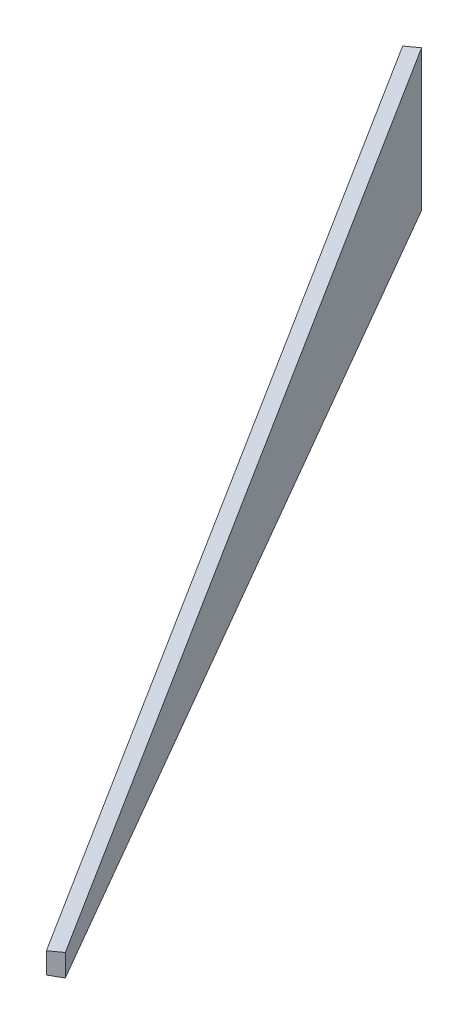
ISO-10303-21;
HEADER;
FILE_DESCRIPTION(('STEP AP214'),'2;1');
FILE_NAME('part.step','',(''),(''),'','','');
FILE_SCHEMA(('AUTOMOTIVE_DESIGN { 1 0 10303 214 1 1 1 1 }'));
ENDSEC;
DATA;
#1=APPLICATION_CONTEXT('core data for automotive mechanical design processes');
#2=APPLICATION_PROTOCOL_DEFINITION('international standard','automotive_design',2000,#1);
#3=PRODUCT_CONTEXT('',#1,'mechanical');
#4=PRODUCT('Part','Part','',(#3));
#5=PRODUCT_RELATED_PRODUCT_CATEGORY('part','',(#4));
#6=PRODUCT_DEFINITION_FORMATION('','',#4);
#7=PRODUCT_DEFINITION_CONTEXT('part definition',#1,'design');
#8=PRODUCT_DEFINITION('design','',#6,#7);
#9=PRODUCT_DEFINITION_SHAPE('','',#8);
#10=(LENGTH_UNIT() NAMED_UNIT(*) SI_UNIT(.MILLI.,.METRE.));
#11=(NAMED_UNIT(*) PLANE_ANGLE_UNIT() SI_UNIT($,.RADIAN.));
#12=(NAMED_UNIT(*) SI_UNIT($,.STERADIAN.) SOLID_ANGLE_UNIT());
#13=UNCERTAINTY_MEASURE_WITH_UNIT(LENGTH_MEASURE(1.E-05),#10,'distance_accuracy_value','');
#14=(GEOMETRIC_REPRESENTATION_CONTEXT(3) GLOBAL_UNCERTAINTY_ASSIGNED_CONTEXT((#13)) GLOBAL_UNIT_ASSIGNED_CONTEXT((#10,
#11,#12)) REPRESENTATION_CONTEXT('',''));
#15=CARTESIAN_POINT('',(0.,0.,0.));
#16=DIRECTION('',(0.,0.,1.));
#17=DIRECTION('',(1.,0.,0.));
#18=AXIS2_PLACEMENT_3D('',#15,#16,#17);
#19=CARTESIAN_POINT('',(12.7,0.,47.3970452561136));
#20=DIRECTION('',(-0.866025403784429,0.,0.500000000000017));
#21=DIRECTION('',(0.500000000000017,0.,0.866025403784429));
#22=AXIS2_PLACEMENT_3D('',#19,#20,#21);
#23=PLANE('',#22);
#24=DIRECTION('',(0.,1.,0.));
#25=VECTOR('',#24,1.);
#26=CARTESIAN_POINT('',(458.901477371994,0.,820.240674476508));
#27=LINE('',#26,#25);
#28=CARTESIAN_POINT('',(458.90147737196,19.3477043955104,820.240674476528));
#29=VERTEX_POINT('',#28);
#30=CARTESIAN_POINT('',(458.901477371959,0.,820.240674476528));
#31=VERTEX_POINT('',#30);
#32=EDGE_CURVE('E20',#29,#31,#27,.F.);
#33=ORIENTED_EDGE('',*,*,#32,.F.);
#34=DIRECTION('',(0.496324642300495,-0.121026434226183,0.859659497512696));
#35=VECTOR('',#34,1.);
#36=CARTESIAN_POINT('',(12.7,128.151840137167,47.3970452561112));
#37=LINE('',#36,#35);
#38=CARTESIAN_POINT('',(12.7,128.15184013718,47.397045256113));
#39=VERTEX_POINT('',#38);
#40=EDGE_CURVE('E79',#39,#29,#37,.T.);
#41=ORIENTED_EDGE('',*,*,#40,.F.);
#42=DIRECTION('',(0.,1.,0.));
#43=VECTOR('',#42,1.);
#44=CARTESIAN_POINT('',(12.7,0.,47.3970452561136));
#45=LINE('',#44,#43);
#46=CARTESIAN_POINT('',(12.7,0.,47.3970452561136));
#47=VERTEX_POINT('',#46);
#48=EDGE_CURVE('E61',#47,#39,#45,.T.);
#49=ORIENTED_EDGE('',*,*,#48,.F.);
#50=DIRECTION('',(0.500000000000094,0.,0.866025403784384));
#51=VECTOR('',#50,1.);
#52=CARTESIAN_POINT('',(12.7,0.,47.3970452561136));
#53=LINE('',#52,#51);
#54=EDGE_CURVE('E56',#47,#31,#53,.T.);
#55=ORIENTED_EDGE('',*,*,#54,.T.);
#56=EDGE_LOOP('',(#33,#41,#49,#55));
#57=FACE_BOUND('',#56,.T.);
#58=ADVANCED_FACE('F17',(#57),#23,.T.);
#59=CARTESIAN_POINT('',(458.901477371994,0.,820.240674476508));
#60=DIRECTION('',(0.500000000000017,0.,0.866025403784429));
#61=DIRECTION('',(0.866025403784429,0.,-0.500000000000017));
#62=AXIS2_PLACEMENT_3D('',#59,#60,#61);
#63=PLANE('',#62);
#64=DIRECTION('',(0.,1.,0.));
#65=VECTOR('',#64,1.);
#66=CARTESIAN_POINT('',(469.9,0.,813.890674476508));
#67=LINE('',#66,#65);
#68=CARTESIAN_POINT('',(469.900000000007,20.2656907587749,813.890674476521));
#69=VERTEX_POINT('',#68);
#70=CARTESIAN_POINT('',(469.900000000007,0.,813.89067447652));
#71=VERTEX_POINT('',#70);
#72=EDGE_CURVE('E83',#69,#71,#67,.F.);
#73=ORIENTED_EDGE('',*,*,#72,.F.);
#74=DIRECTION('',(0.863771850104114,0.0720942990424097,-0.498698910178576));
#75=VECTOR('',#74,1.);
#76=CARTESIAN_POINT('',(458.901477371994,19.3477043955206,820.24067447651));
#77=LINE('',#76,#75);
#78=EDGE_CURVE('E68',#29,#69,#77,.T.);
#79=ORIENTED_EDGE('',*,*,#78,.F.);
#80=ORIENTED_EDGE('',*,*,#32,.T.);
#81=DIRECTION('',(0.86602540378333,0.,-0.50000000000192));
#82=VECTOR('',#81,1.);
#83=CARTESIAN_POINT('',(458.901477371994,0.,820.240674476508));
#84=LINE('',#83,#82);
#85=EDGE_CURVE('E63',#31,#71,#84,.T.);
#86=ORIENTED_EDGE('',*,*,#85,.T.);
#87=EDGE_LOOP('',(#73,#79,#80,#86));
#88=FACE_BOUND('',#87,.T.);
#89=ADVANCED_FACE('F65',(#88),#63,.T.);
#90=CARTESIAN_POINT('',(0.,0.,0.));
#91=DIRECTION('',(0.,1.,0.));
#92=DIRECTION('',(0.,0.,1.));
#93=AXIS2_PLACEMENT_3D('',#90,#91,#92);
#94=PLANE('',#93);
#95=DIRECTION('',(-0.500000000000017,0.,-0.866025403784429));
#96=VECTOR('',#95,1.);
#97=CARTESIAN_POINT('',(469.9,0.,813.890674476508));
#98=LINE('',#97,#96);
#99=CARTESIAN_POINT('',(23.6985226280686,0.,41.0470452561097));
#100=VERTEX_POINT('',#99);
#101=EDGE_CURVE('E72',#71,#100,#98,.T.);
#102=ORIENTED_EDGE('',*,*,#101,.F.);
#103=ORIENTED_EDGE('',*,*,#85,.F.);
#104=ORIENTED_EDGE('',*,*,#54,.F.);
#105=DIRECTION('',(-0.866025403784429,0.,0.500000000000017));
#106=VECTOR('',#105,1.);
#107=CARTESIAN_POINT('',(23.6985226280619,0.,41.0470452561136));
#108=LINE('',#107,#106);
#109=EDGE_CURVE('E74',#100,#47,#108,.T.);
#110=ORIENTED_EDGE('',*,*,#109,.F.);
#111=EDGE_LOOP('',(#102,#103,#104,#110));
#112=FACE_BOUND('',#111,.T.);
#113=ADVANCED_FACE('F70',(#112),#94,.F.);
#114=CARTESIAN_POINT('',(23.6985226280619,0.,41.0470452561136));
#115=DIRECTION('',(-0.500000000000017,0.,-0.866025403784429));
#116=DIRECTION('',(-0.866025403784429,0.,0.500000000000017));
#117=AXIS2_PLACEMENT_3D('',#114,#115,#116);
#118=PLANE('',#117);
#119=ORIENTED_EDGE('',*,*,#48,.T.);
#120=DIRECTION('',(-0.863771850105242,-0.0720942990421396,0.498698910176661));
#121=VECTOR('',#120,1.);
#122=CARTESIAN_POINT('',(23.6985226280619,129.069826500433,41.0470452561118));
#123=LINE('',#122,#121);
#124=CARTESIAN_POINT('',(23.6985226280687,129.069826500442,41.0470452561092));
#125=VERTEX_POINT('',#124);
#126=EDGE_CURVE('E35',#125,#39,#123,.T.);
#127=ORIENTED_EDGE('',*,*,#126,.F.);
#128=DIRECTION('',(0.,1.,0.));
#129=VECTOR('',#128,1.);
#130=CARTESIAN_POINT('',(23.6985226280889,0.,41.0470452560978));
#131=LINE('',#130,#129);
#132=EDGE_CURVE('E26',#100,#125,#131,.T.);
#133=ORIENTED_EDGE('',*,*,#132,.F.);
#134=ORIENTED_EDGE('',*,*,#109,.T.);
#135=EDGE_LOOP('',(#119,#127,#133,#134));
#136=FACE_BOUND('',#135,.T.);
#137=ADVANCED_FACE('F89',(#136),#118,.T.);
#138=CARTESIAN_POINT('',(241.3,74.2087654479838,430.64385986626));
#139=DIRECTION('',(-0.00162085973705502,0.990103922422824,0.140326745906303));
#140=DIRECTION('',(0.,-0.140326930238918,0.99010522301911));
#141=AXIS2_PLACEMENT_3D('',#138,#139,#140);
#142=PLANE('',#141);
#143=DIRECTION('',(0.496324642300418,-0.121026434226217,0.859659497512735));
#144=VECTOR('',#143,1.);
#145=CARTESIAN_POINT('',(23.6985226280889,129.069826500445,41.0470452560978));
#146=LINE('',#145,#144);
#147=EDGE_CURVE('E11',#125,#69,#146,.T.);
#148=ORIENTED_EDGE('',*,*,#147,.F.);
#149=ORIENTED_EDGE('',*,*,#126,.T.);
#150=ORIENTED_EDGE('',*,*,#40,.T.);
#151=ORIENTED_EDGE('',*,*,#78,.T.);
#152=EDGE_LOOP('',(#148,#149,#150,#151));
#153=FACE_BOUND('',#152,.T.);
#154=ADVANCED_FACE('F91',(#153),#142,.T.);
#155=CARTESIAN_POINT('',(469.9,0.,813.890674476508));
#156=DIRECTION('',(0.866025403784429,0.,-0.500000000000017));
#157=DIRECTION('',(-0.500000000000017,0.,-0.866025403784429));
#158=AXIS2_PLACEMENT_3D('',#155,#156,#157);
#159=PLANE('',#158);
#160=ORIENTED_EDGE('',*,*,#132,.T.);
#161=ORIENTED_EDGE('',*,*,#147,.T.);
#162=ORIENTED_EDGE('',*,*,#72,.T.);
#163=ORIENTED_EDGE('',*,*,#101,.T.);
#164=EDGE_LOOP('',(#160,#161,#162,#163));
#165=FACE_BOUND('',#164,.T.);
#166=ADVANCED_FACE('F88',(#165),#159,.T.);
#167=CLOSED_SHELL('',(#58,#89,#113,#137,#154,#166));
#168=MANIFOLD_SOLID_BREP('B1',#167);
#169=ADVANCED_BREP_SHAPE_REPRESENTATION('',(#18,#168),#14);
#170=SHAPE_DEFINITION_REPRESENTATION(#9,#169);
ENDSEC;
END-ISO-10303-21;
